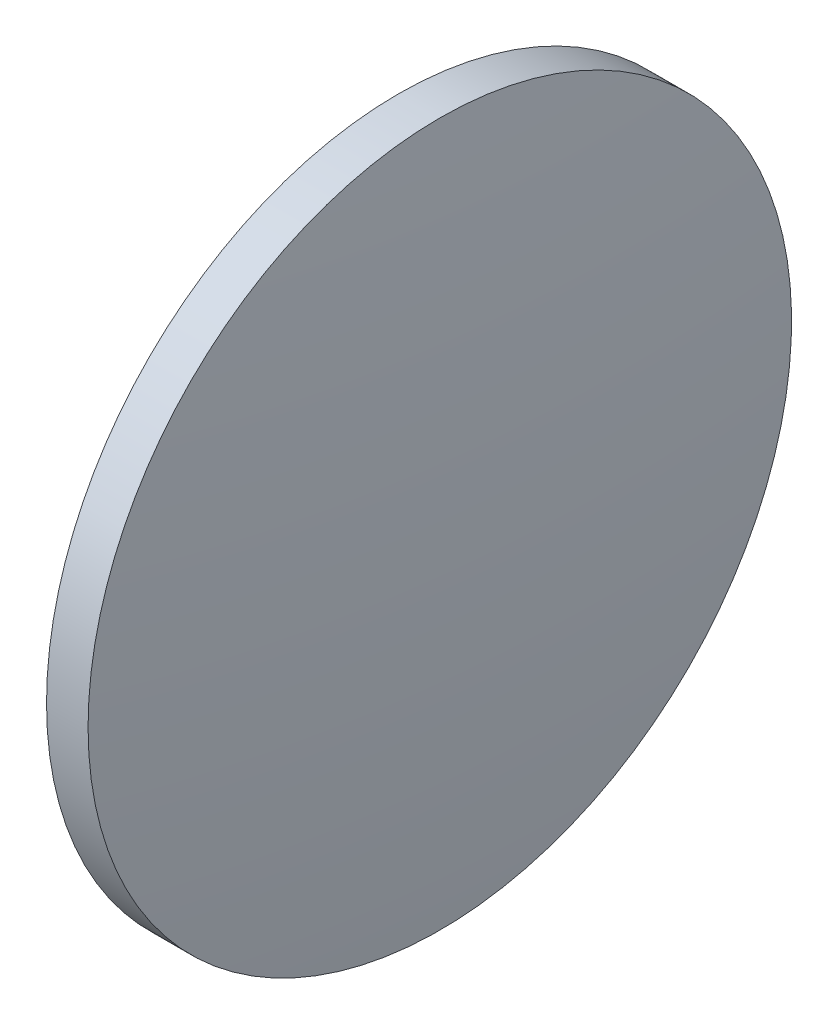
ISO-10303-21;
HEADER;
FILE_DESCRIPTION(('STEP AP214'),'2;1');
FILE_NAME('part.step','',(''),(''),'','','');
FILE_SCHEMA(('AUTOMOTIVE_DESIGN { 1 0 10303 214 1 1 1 1 }'));
ENDSEC;
DATA;
#1=APPLICATION_CONTEXT('core data for automotive mechanical design processes');
#2=APPLICATION_PROTOCOL_DEFINITION('international standard','automotive_design',2000,#1);
#3=PRODUCT_CONTEXT('',#1,'mechanical');
#4=PRODUCT('Part','Part','',(#3));
#5=PRODUCT_RELATED_PRODUCT_CATEGORY('part','',(#4));
#6=PRODUCT_DEFINITION_FORMATION('','',#4);
#7=PRODUCT_DEFINITION_CONTEXT('part definition',#1,'design');
#8=PRODUCT_DEFINITION('design','',#6,#7);
#9=PRODUCT_DEFINITION_SHAPE('','',#8);
#10=(LENGTH_UNIT() NAMED_UNIT(*) SI_UNIT(.MILLI.,.METRE.));
#11=(NAMED_UNIT(*) PLANE_ANGLE_UNIT() SI_UNIT($,.RADIAN.));
#12=(NAMED_UNIT(*) SI_UNIT($,.STERADIAN.) SOLID_ANGLE_UNIT());
#13=UNCERTAINTY_MEASURE_WITH_UNIT(LENGTH_MEASURE(1.E-05),#10,'distance_accuracy_value','');
#14=(GEOMETRIC_REPRESENTATION_CONTEXT(3) GLOBAL_UNCERTAINTY_ASSIGNED_CONTEXT((#13)) GLOBAL_UNIT_ASSIGNED_CONTEXT((#10,
#11,#12)) REPRESENTATION_CONTEXT('',''));
#15=CARTESIAN_POINT('',(0.,0.,0.));
#16=DIRECTION('',(0.,0.,1.));
#17=DIRECTION('',(1.,0.,0.));
#18=AXIS2_PLACEMENT_3D('',#15,#16,#17);
#19=CARTESIAN_POINT('',(439.640131694059,97.232226046369,0.));
#20=DIRECTION('',(-1.,0.,0.));
#21=DIRECTION('',(0.,1.,0.));
#22=AXIS2_PLACEMENT_3D('',#19,#20,#21);
#23=SPHERICAL_SURFACE('',#22,269.423691573306);
#24=CARTESIAN_POINT('',(171.416408692182,97.2322260463696,0.));
#25=DIRECTION('',(-1.,0.,0.));
#26=DIRECTION('',(0.,0.,1.));
#27=AXIS2_PLACEMENT_3D('',#24,#25,#26);
#28=CIRCLE('',#27,25.4);
#29=CARTESIAN_POINT('',(171.416408692182,97.2322260463696,25.4));
#30=VERTEX_POINT('',#29);
#31=EDGE_CURVE('E46',#30,#30,#28,.T.);
#32=ORIENTED_EDGE('',*,*,#31,.T.);
#33=EDGE_LOOP('',(#32));
#34=FACE_BOUND('',#33,.T.);
#35=ADVANCED_FACE('F39',(#34),#23,.T.);
#36=CARTESIAN_POINT('',(-93.8073565954089,97.2322260463689,0.));
#37=DIRECTION('',(-1.,0.,0.));
#38=DIRECTION('',(0.,1.,0.));
#39=AXIS2_PLACEMENT_3D('',#36,#37,#38);
#40=SPHERICAL_SURFACE('',#39,269.423691573305);
#41=CARTESIAN_POINT('',(174.416366406468,97.2322260463696,0.));
#42=DIRECTION('',(-1.,0.,0.));
#43=DIRECTION('',(0.,0.,1.));
#44=AXIS2_PLACEMENT_3D('',#41,#42,#43);
#45=CIRCLE('',#44,25.4);
#46=CARTESIAN_POINT('',(174.416366406468,97.2322260463696,25.4));
#47=VERTEX_POINT('',#46);
#48=EDGE_CURVE('E10',#47,#47,#45,.T.);
#49=ORIENTED_EDGE('',*,*,#48,.F.);
#50=EDGE_LOOP('',(#49));
#51=FACE_BOUND('',#50,.T.);
#52=ADVANCED_FACE('F56',(#51),#40,.T.);
#53=CARTESIAN_POINT('',(165.744107942151,97.2322260463696,0.));
#54=DIRECTION('',(-1.,0.,0.));
#55=DIRECTION('',(0.,0.,1.));
#56=AXIS2_PLACEMENT_3D('',#53,#54,#55);
#57=CYLINDRICAL_SURFACE('',#56,25.4);
#58=ORIENTED_EDGE('',*,*,#48,.T.);
#59=EDGE_LOOP('',(#58));
#60=FACE_BOUND('',#59,.T.);
#61=ORIENTED_EDGE('',*,*,#31,.F.);
#62=EDGE_LOOP('',(#61));
#63=FACE_BOUND('',#62,.T.);
#64=ADVANCED_FACE('F54',(#60,#63),#57,.T.);
#65=CLOSED_SHELL('',(#35,#52,#64));
#66=MANIFOLD_SOLID_BREP('B2',#65);
#67=ADVANCED_BREP_SHAPE_REPRESENTATION('',(#18,#66),#14);
#68=SHAPE_DEFINITION_REPRESENTATION(#9,#67);
ENDSEC;
END-ISO-10303-21;
